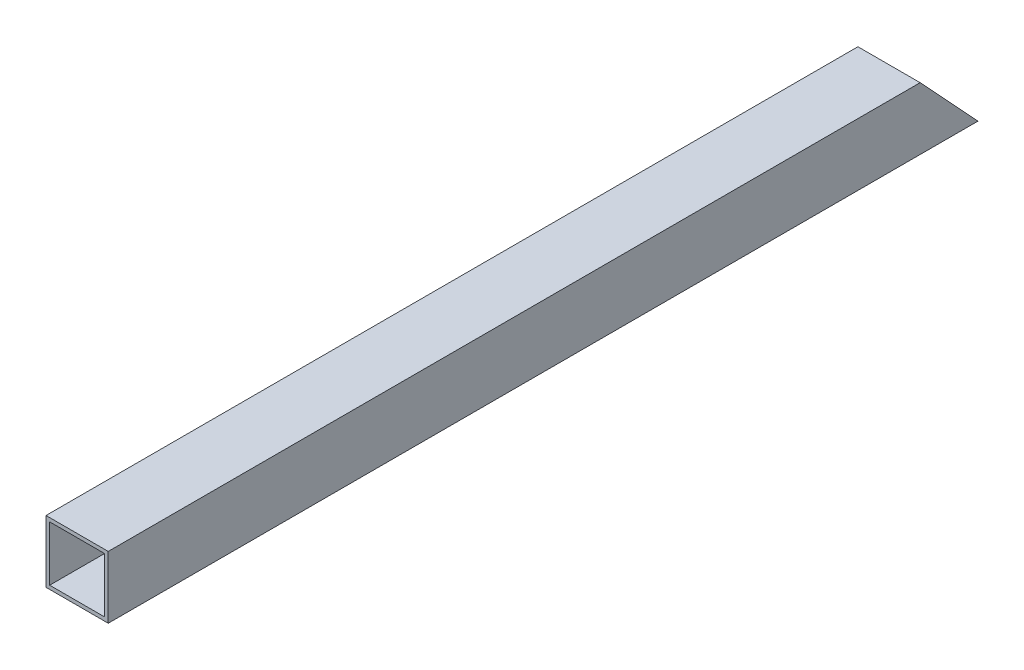
ISO-10303-21;
HEADER;
FILE_DESCRIPTION(('STEP AP214'),'2;1');
FILE_NAME('part.step','',(''),(''),'','','');
FILE_SCHEMA(('AUTOMOTIVE_DESIGN { 1 0 10303 214 1 1 1 1 }'));
ENDSEC;
DATA;
#1=APPLICATION_CONTEXT('core data for automotive mechanical design processes');
#2=APPLICATION_PROTOCOL_DEFINITION('international standard','automotive_design',2000,#1);
#3=PRODUCT_CONTEXT('',#1,'mechanical');
#4=PRODUCT('Part','Part','',(#3));
#5=PRODUCT_RELATED_PRODUCT_CATEGORY('part','',(#4));
#6=PRODUCT_DEFINITION_FORMATION('','',#4);
#7=PRODUCT_DEFINITION_CONTEXT('part definition',#1,'design');
#8=PRODUCT_DEFINITION('design','',#6,#7);
#9=PRODUCT_DEFINITION_SHAPE('','',#8);
#10=(LENGTH_UNIT() NAMED_UNIT(*) SI_UNIT(.MILLI.,.METRE.));
#11=(NAMED_UNIT(*) PLANE_ANGLE_UNIT() SI_UNIT($,.RADIAN.));
#12=(NAMED_UNIT(*) SI_UNIT($,.STERADIAN.) SOLID_ANGLE_UNIT());
#13=UNCERTAINTY_MEASURE_WITH_UNIT(LENGTH_MEASURE(1.E-05),#10,'distance_accuracy_value','');
#14=(GEOMETRIC_REPRESENTATION_CONTEXT(3) GLOBAL_UNCERTAINTY_ASSIGNED_CONTEXT((#13)) GLOBAL_UNIT_ASSIGNED_CONTEXT((#10,
#11,#12)) REPRESENTATION_CONTEXT('',''));
#15=CARTESIAN_POINT('',(0.,0.,0.));
#16=DIRECTION('',(0.,0.,1.));
#17=DIRECTION('',(1.,0.,0.));
#18=AXIS2_PLACEMENT_3D('',#15,#16,#17);
#19=CARTESIAN_POINT('',(0.,0.,355.));
#20=DIRECTION('',(0.,0.,-1.));
#21=DIRECTION('',(-1.,0.,0.));
#22=AXIS2_PLACEMENT_3D('',#19,#20,#21);
#23=PLANE('',#22);
#24=DIRECTION('',(0.,1.,0.));
#25=VECTOR('',#24,1.);
#26=CARTESIAN_POINT('',(12.7,-12.7,355.));
#27=LINE('',#26,#25);
#28=CARTESIAN_POINT('',(12.7,-12.7,355.));
#29=VERTEX_POINT('',#28);
#30=CARTESIAN_POINT('',(12.7,12.7,355.));
#31=VERTEX_POINT('',#30);
#32=EDGE_CURVE('E129',#29,#31,#27,.T.);
#33=ORIENTED_EDGE('',*,*,#32,.T.);
#34=DIRECTION('',(-1.,0.,0.));
#35=VECTOR('',#34,1.);
#36=CARTESIAN_POINT('',(-12.7,12.7,355.));
#37=LINE('',#36,#35);
#38=CARTESIAN_POINT('',(-12.7,12.7,355.));
#39=VERTEX_POINT('',#38);
#40=EDGE_CURVE('E117',#31,#39,#37,.T.);
#41=ORIENTED_EDGE('',*,*,#40,.T.);
#42=DIRECTION('',(0.,-1.,0.));
#43=VECTOR('',#42,1.);
#44=CARTESIAN_POINT('',(-12.7,-12.7,355.));
#45=LINE('',#44,#43);
#46=CARTESIAN_POINT('',(-12.7,-12.7,355.));
#47=VERTEX_POINT('',#46);
#48=EDGE_CURVE('E132',#39,#47,#45,.T.);
#49=ORIENTED_EDGE('',*,*,#48,.T.);
#50=DIRECTION('',(1.,0.,0.));
#51=VECTOR('',#50,1.);
#52=CARTESIAN_POINT('',(-12.7,-12.7,355.));
#53=LINE('',#52,#51);
#54=EDGE_CURVE('E126',#47,#29,#53,.T.);
#55=ORIENTED_EDGE('',*,*,#54,.T.);
#56=EDGE_LOOP('',(#33,#41,#49,#55));
#57=FACE_BOUND('',#56,.T.);
#58=DIRECTION('',(0.,1.,0.));
#59=VECTOR('',#58,1.);
#60=CARTESIAN_POINT('',(11.2,-11.2,355.));
#61=LINE('',#60,#59);
#62=CARTESIAN_POINT('',(11.2,-11.2,355.));
#63=VERTEX_POINT('',#62);
#64=CARTESIAN_POINT('',(11.2,11.2,355.));
#65=VERTEX_POINT('',#64);
#66=EDGE_CURVE('E151',#63,#65,#61,.T.);
#67=ORIENTED_EDGE('',*,*,#66,.F.);
#68=DIRECTION('',(1.,0.,0.));
#69=VECTOR('',#68,1.);
#70=CARTESIAN_POINT('',(-11.2,-11.2,355.));
#71=LINE('',#70,#69);
#72=CARTESIAN_POINT('',(-11.2,-11.2,355.));
#73=VERTEX_POINT('',#72);
#74=EDGE_CURVE('E145',#73,#63,#71,.T.);
#75=ORIENTED_EDGE('',*,*,#74,.F.);
#76=DIRECTION('',(0.,-1.,0.));
#77=VECTOR('',#76,1.);
#78=CARTESIAN_POINT('',(-11.2,-11.2,355.));
#79=LINE('',#78,#77);
#80=CARTESIAN_POINT('',(-11.2,11.2,355.));
#81=VERTEX_POINT('',#80);
#82=EDGE_CURVE('E147',#81,#73,#79,.T.);
#83=ORIENTED_EDGE('',*,*,#82,.F.);
#84=DIRECTION('',(-1.,0.,0.));
#85=VECTOR('',#84,1.);
#86=CARTESIAN_POINT('',(-11.2,11.2,355.));
#87=LINE('',#86,#85);
#88=EDGE_CURVE('E149',#65,#81,#87,.T.);
#89=ORIENTED_EDGE('',*,*,#88,.F.);
#90=EDGE_LOOP('',(#67,#75,#83,#89));
#91=FACE_BOUND('',#90,.T.);
#92=ADVANCED_FACE('F34',(#57,#91),#23,.F.);
#93=CARTESIAN_POINT('',(12.7,-12.7,355.));
#94=DIRECTION('',(-1.,0.,0.));
#95=DIRECTION('',(0.,0.,1.));
#96=AXIS2_PLACEMENT_3D('',#93,#94,#95);
#97=PLANE('',#96);
#98=DIRECTION('',(0.,0.,-1.));
#99=VECTOR('',#98,1.);
#100=CARTESIAN_POINT('',(12.7,-12.7,355.));
#101=LINE('',#100,#99);
#102=CARTESIAN_POINT('',(12.7,-12.7,0.));
#103=VERTEX_POINT('',#102);
#104=EDGE_CURVE('E114',#29,#103,#101,.T.);
#105=ORIENTED_EDGE('',*,*,#104,.T.);
#106=DIRECTION('',(0.,0.732300412469109,0.680981722146471));
#107=VECTOR('',#106,1.);
#108=CARTESIAN_POINT('',(12.7,-12.7,0.));
#109=LINE('',#108,#107);
#110=CARTESIAN_POINT('',(12.7,12.7,23.62));
#111=VERTEX_POINT('',#110);
#112=EDGE_CURVE('E100',#103,#111,#109,.T.);
#113=ORIENTED_EDGE('',*,*,#112,.T.);
#114=DIRECTION('',(0.,0.,-1.));
#115=VECTOR('',#114,1.);
#116=CARTESIAN_POINT('',(12.7,12.7,355.));
#117=LINE('',#116,#115);
#118=EDGE_CURVE('E42',#31,#111,#117,.T.);
#119=ORIENTED_EDGE('',*,*,#118,.F.);
#120=ORIENTED_EDGE('',*,*,#32,.F.);
#121=EDGE_LOOP('',(#105,#113,#119,#120));
#122=FACE_BOUND('',#121,.T.);
#123=ADVANCED_FACE('F36',(#122),#97,.F.);
#124=CARTESIAN_POINT('',(-12.7,12.7,355.));
#125=DIRECTION('',(0.,-1.,0.));
#126=DIRECTION('',(1.,0.,0.));
#127=AXIS2_PLACEMENT_3D('',#124,#125,#126);
#128=PLANE('',#127);
#129=ORIENTED_EDGE('',*,*,#118,.T.);
#130=DIRECTION('',(-1.,0.,0.));
#131=VECTOR('',#130,1.);
#132=CARTESIAN_POINT('',(12.7,12.7,23.62));
#133=LINE('',#132,#131);
#134=CARTESIAN_POINT('',(-12.7,12.7,23.62));
#135=VERTEX_POINT('',#134);
#136=EDGE_CURVE('E97',#111,#135,#133,.T.);
#137=ORIENTED_EDGE('',*,*,#136,.T.);
#138=DIRECTION('',(0.,0.,-1.));
#139=VECTOR('',#138,1.);
#140=CARTESIAN_POINT('',(-12.7,12.7,355.));
#141=LINE('',#140,#139);
#142=EDGE_CURVE('E119',#39,#135,#141,.T.);
#143=ORIENTED_EDGE('',*,*,#142,.F.);
#144=ORIENTED_EDGE('',*,*,#40,.F.);
#145=EDGE_LOOP('',(#129,#137,#143,#144));
#146=FACE_BOUND('',#145,.T.);
#147=ADVANCED_FACE('F116',(#146),#128,.F.);
#148=CARTESIAN_POINT('',(-12.7,-12.7,355.));
#149=DIRECTION('',(1.,0.,0.));
#150=DIRECTION('',(0.,0.,-1.));
#151=AXIS2_PLACEMENT_3D('',#148,#149,#150);
#152=PLANE('',#151);
#153=ORIENTED_EDGE('',*,*,#142,.T.);
#154=DIRECTION('',(0.,0.732300412469109,0.680981722146471));
#155=VECTOR('',#154,1.);
#156=CARTESIAN_POINT('',(-12.7,-12.7,0.));
#157=LINE('',#156,#155);
#158=CARTESIAN_POINT('',(-12.7,-12.7,0.));
#159=VERTEX_POINT('',#158);
#160=EDGE_CURVE('E103',#159,#135,#157,.T.);
#161=ORIENTED_EDGE('',*,*,#160,.F.);
#162=DIRECTION('',(0.,0.,-1.));
#163=VECTOR('',#162,1.);
#164=CARTESIAN_POINT('',(-12.7,-12.7,355.));
#165=LINE('',#164,#163);
#166=EDGE_CURVE('E120',#47,#159,#165,.T.);
#167=ORIENTED_EDGE('',*,*,#166,.F.);
#168=ORIENTED_EDGE('',*,*,#48,.F.);
#169=EDGE_LOOP('',(#153,#161,#167,#168));
#170=FACE_BOUND('',#169,.T.);
#171=ADVANCED_FACE('F183',(#170),#152,.F.);
#172=CARTESIAN_POINT('',(-12.7,-12.7,355.));
#173=DIRECTION('',(0.,1.,0.));
#174=DIRECTION('',(-1.,0.,0.));
#175=AXIS2_PLACEMENT_3D('',#172,#173,#174);
#176=PLANE('',#175);
#177=DIRECTION('',(1.,0.,0.));
#178=VECTOR('',#177,1.);
#179=CARTESIAN_POINT('',(-12.7,-12.7,0.));
#180=LINE('',#179,#178);
#181=EDGE_CURVE('E127',#159,#103,#180,.T.);
#182=ORIENTED_EDGE('',*,*,#181,.T.);
#183=ORIENTED_EDGE('',*,*,#104,.F.);
#184=ORIENTED_EDGE('',*,*,#54,.F.);
#185=ORIENTED_EDGE('',*,*,#166,.T.);
#186=EDGE_LOOP('',(#182,#183,#184,#185));
#187=FACE_BOUND('',#186,.T.);
#188=ADVANCED_FACE('F176',(#187),#176,.F.);
#189=CARTESIAN_POINT('',(11.2,-11.2,355.));
#190=DIRECTION('',(-1.,0.,0.));
#191=DIRECTION('',(0.,0.,1.));
#192=AXIS2_PLACEMENT_3D('',#189,#190,#191);
#193=PLANE('',#192);
#194=DIRECTION('',(0.,0.732300412469109,0.680981722146471));
#195=VECTOR('',#194,1.);
#196=CARTESIAN_POINT('',(11.2,165.136930425337,165.374342387656));
#197=LINE('',#196,#195);
#198=CARTESIAN_POINT('',(11.2,-11.2,1.39488188976378));
#199=VERTEX_POINT('',#198);
#200=CARTESIAN_POINT('',(11.2,11.2,22.2251181102362));
#201=VERTEX_POINT('',#200);
#202=EDGE_CURVE('E153',#199,#201,#197,.T.);
#203=ORIENTED_EDGE('',*,*,#202,.F.);
#204=DIRECTION('',(0.,0.,-1.));
#205=VECTOR('',#204,1.);
#206=CARTESIAN_POINT('',(11.2,-11.2,355.));
#207=LINE('',#206,#205);
#208=EDGE_CURVE('E142',#63,#199,#207,.T.);
#209=ORIENTED_EDGE('',*,*,#208,.F.);
#210=ORIENTED_EDGE('',*,*,#66,.T.);
#211=DIRECTION('',(0.,0.,-1.));
#212=VECTOR('',#211,1.);
#213=CARTESIAN_POINT('',(11.2,11.2,355.));
#214=LINE('',#213,#212);
#215=EDGE_CURVE('E130',#65,#201,#214,.T.);
#216=ORIENTED_EDGE('',*,*,#215,.T.);
#217=EDGE_LOOP('',(#203,#209,#210,#216));
#218=FACE_BOUND('',#217,.T.);
#219=ADVANCED_FACE('F174',(#218),#193,.T.);
#220=CARTESIAN_POINT('',(-11.2,11.2,355.));
#221=DIRECTION('',(0.,-1.,0.));
#222=DIRECTION('',(0.,0.,-1.));
#223=AXIS2_PLACEMENT_3D('',#220,#221,#222);
#224=PLANE('',#223);
#225=DIRECTION('',(-1.,0.,0.));
#226=VECTOR('',#225,1.);
#227=CARTESIAN_POINT('',(-11.2,11.2,22.2251181102362));
#228=LINE('',#227,#226);
#229=CARTESIAN_POINT('',(-11.2,11.2,22.2251181102362));
#230=VERTEX_POINT('',#229);
#231=EDGE_CURVE('E155',#201,#230,#228,.T.);
#232=ORIENTED_EDGE('',*,*,#231,.F.);
#233=ORIENTED_EDGE('',*,*,#215,.F.);
#234=ORIENTED_EDGE('',*,*,#88,.T.);
#235=DIRECTION('',(0.,0.,-1.));
#236=VECTOR('',#235,1.);
#237=CARTESIAN_POINT('',(-11.2,11.2,355.));
#238=LINE('',#237,#236);
#239=EDGE_CURVE('E138',#81,#230,#238,.T.);
#240=ORIENTED_EDGE('',*,*,#239,.T.);
#241=EDGE_LOOP('',(#232,#233,#234,#240));
#242=FACE_BOUND('',#241,.T.);
#243=ADVANCED_FACE('F166',(#242),#224,.T.);
#244=CARTESIAN_POINT('',(-11.2,-11.2,355.));
#245=DIRECTION('',(1.,0.,0.));
#246=DIRECTION('',(0.,0.,-1.));
#247=AXIS2_PLACEMENT_3D('',#244,#245,#246);
#248=PLANE('',#247);
#249=DIRECTION('',(0.,-0.732300412469109,-0.680981722146471));
#250=VECTOR('',#249,1.);
#251=CARTESIAN_POINT('',(-11.2,165.136930425337,165.374342387656));
#252=LINE('',#251,#250);
#253=CARTESIAN_POINT('',(-11.2,-11.2,1.39488188976378));
#254=VERTEX_POINT('',#253);
#255=EDGE_CURVE('E48',#230,#254,#252,.T.);
#256=ORIENTED_EDGE('',*,*,#255,.F.);
#257=ORIENTED_EDGE('',*,*,#239,.F.);
#258=ORIENTED_EDGE('',*,*,#82,.T.);
#259=DIRECTION('',(0.,0.,-1.));
#260=VECTOR('',#259,1.);
#261=CARTESIAN_POINT('',(-11.2,-11.2,355.));
#262=LINE('',#261,#260);
#263=EDGE_CURVE('E55',#73,#254,#262,.T.);
#264=ORIENTED_EDGE('',*,*,#263,.T.);
#265=EDGE_LOOP('',(#256,#257,#258,#264));
#266=FACE_BOUND('',#265,.T.);
#267=ADVANCED_FACE('F164',(#266),#248,.T.);
#268=CARTESIAN_POINT('',(-11.2,-11.2,355.));
#269=DIRECTION('',(0.,1.,0.));
#270=DIRECTION('',(0.,0.,1.));
#271=AXIS2_PLACEMENT_3D('',#268,#269,#270);
#272=PLANE('',#271);
#273=DIRECTION('',(1.,0.,0.));
#274=VECTOR('',#273,1.);
#275=CARTESIAN_POINT('',(-11.2,-11.2,1.39488188976378));
#276=LINE('',#275,#274);
#277=EDGE_CURVE('E11',#254,#199,#276,.T.);
#278=ORIENTED_EDGE('',*,*,#277,.F.);
#279=ORIENTED_EDGE('',*,*,#263,.F.);
#280=ORIENTED_EDGE('',*,*,#74,.T.);
#281=ORIENTED_EDGE('',*,*,#208,.T.);
#282=EDGE_LOOP('',(#278,#279,#280,#281));
#283=FACE_BOUND('',#282,.T.);
#284=ADVANCED_FACE('F172',(#283),#272,.T.);
#285=CARTESIAN_POINT('',(12.7,-12.7,0.));
#286=DIRECTION('',(0.,-0.680981722146471,0.732300412469109));
#287=DIRECTION('',(0.,-0.732300412469109,-0.680981722146471));
#288=AXIS2_PLACEMENT_3D('',#285,#286,#287);
#289=PLANE('',#288);
#290=ORIENTED_EDGE('',*,*,#202,.T.);
#291=ORIENTED_EDGE('',*,*,#231,.T.);
#292=ORIENTED_EDGE('',*,*,#255,.T.);
#293=ORIENTED_EDGE('',*,*,#277,.T.);
#294=EDGE_LOOP('',(#290,#291,#292,#293));
#295=FACE_BOUND('',#294,.T.);
#296=ORIENTED_EDGE('',*,*,#160,.T.);
#297=ORIENTED_EDGE('',*,*,#136,.F.);
#298=ORIENTED_EDGE('',*,*,#112,.F.);
#299=ORIENTED_EDGE('',*,*,#181,.F.);
#300=EDGE_LOOP('',(#296,#297,#298,#299));
#301=FACE_BOUND('',#300,.T.);
#302=ADVANCED_FACE('F99',(#295,#301),#289,.F.);
#303=CLOSED_SHELL('',(#92,#123,#147,#171,#188,#219,#243,#267,#284,#302));
#304=MANIFOLD_SOLID_BREP('B2',#303);
#305=ADVANCED_BREP_SHAPE_REPRESENTATION('',(#18,#304),#14);
#306=SHAPE_DEFINITION_REPRESENTATION(#9,#305);
ENDSEC;
END-ISO-10303-21;
